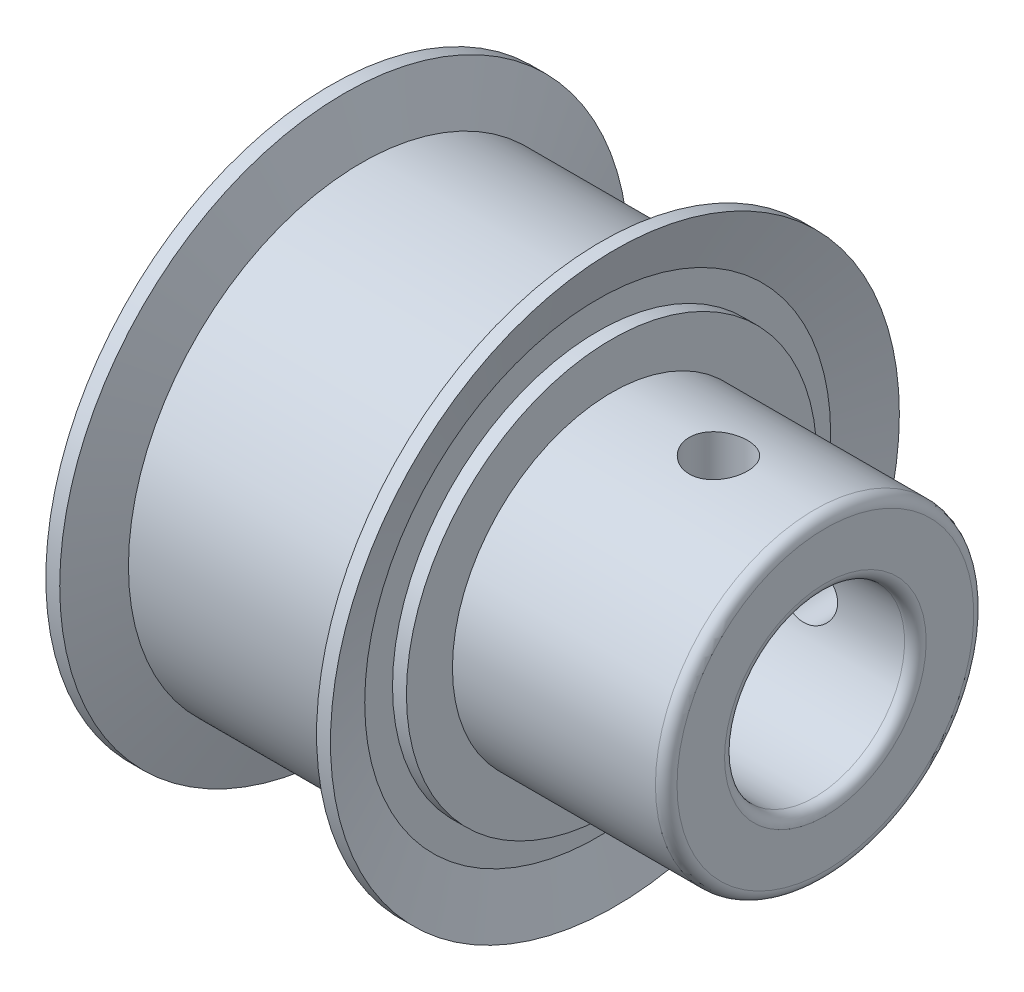
ISO-10303-21;
HEADER;
FILE_DESCRIPTION(('STEP AP214'),'2;1');
FILE_NAME('part.step','',(''),(''),'','','');
FILE_SCHEMA(('AUTOMOTIVE_DESIGN { 1 0 10303 214 1 1 1 1 }'));
ENDSEC;
DATA;
#1=APPLICATION_CONTEXT('core data for automotive mechanical design processes');
#2=APPLICATION_PROTOCOL_DEFINITION('international standard','automotive_design',2000,#1);
#3=PRODUCT_CONTEXT('',#1,'mechanical');
#4=PRODUCT('Part','Part','',(#3));
#5=PRODUCT_RELATED_PRODUCT_CATEGORY('part','',(#4));
#6=PRODUCT_DEFINITION_FORMATION('','',#4);
#7=PRODUCT_DEFINITION_CONTEXT('part definition',#1,'design');
#8=PRODUCT_DEFINITION('design','',#6,#7);
#9=PRODUCT_DEFINITION_SHAPE('','',#8);
#10=(LENGTH_UNIT() NAMED_UNIT(*) SI_UNIT(.MILLI.,.METRE.));
#11=(NAMED_UNIT(*) PLANE_ANGLE_UNIT() SI_UNIT($,.RADIAN.));
#12=(NAMED_UNIT(*) SI_UNIT($,.STERADIAN.) SOLID_ANGLE_UNIT());
#13=UNCERTAINTY_MEASURE_WITH_UNIT(LENGTH_MEASURE(1.E-05),#10,'distance_accuracy_value','');
#14=(GEOMETRIC_REPRESENTATION_CONTEXT(3) GLOBAL_UNCERTAINTY_ASSIGNED_CONTEXT((#13)) GLOBAL_UNIT_ASSIGNED_CONTEXT((#10,
#11,#12)) REPRESENTATION_CONTEXT('',''));
#15=CARTESIAN_POINT('',(0.,0.,0.));
#16=DIRECTION('',(0.,0.,1.));
#17=DIRECTION('',(1.,0.,0.));
#18=AXIS2_PLACEMENT_3D('',#15,#16,#17);
#19=CARTESIAN_POINT('',(-8.6725125,0.,0.));
#20=DIRECTION('',(-1.,0.,0.));
#21=DIRECTION('',(0.,0.,1.));
#22=AXIS2_PLACEMENT_3D('',#19,#20,#21);
#23=CYLINDRICAL_SURFACE('',#22,5.6134);
#24=CARTESIAN_POINT('',(8.2915125,0.,0.));
#25=DIRECTION('',(-1.,0.,0.));
#26=DIRECTION('',(0.,0.,1.));
#27=AXIS2_PLACEMENT_3D('',#24,#25,#26);
#28=CIRCLE('',#27,5.6134);
#29=CARTESIAN_POINT('',(8.2915125,0.,5.6134));
#30=VERTEX_POINT('',#29);
#31=EDGE_CURVE('E10',#30,#30,#28,.T.);
#32=ORIENTED_EDGE('',*,*,#31,.T.);
#33=EDGE_LOOP('',(#32));
#34=FACE_BOUND('',#33,.T.);
#35=CARTESIAN_POINT('',(4.9022,5.51833633172173,-1.0287));
#36=CARTESIAN_POINT('',(4.84494043161623,5.51833742712361,-1.02869777971192));
#37=CARTESIAN_POINT('',(4.78765177515355,5.51923721458514,-1.02390300699142));
#38=CARTESIAN_POINT('',(4.6746881624936,5.52273491839648,-1.00486254906059));
#39=CARTESIAN_POINT('',(4.61901464396117,5.52533430191379,-0.990608698191036));
#40=CARTESIAN_POINT('',(4.51093220953243,5.53192713694505,-0.953101083945397));
#41=CARTESIAN_POINT('',(4.45852036969039,5.53591931803154,-0.929855520183488));
#42=CARTESIAN_POINT('',(4.3583443139881,5.54484642636327,-0.875045795370629));
#43=CARTESIAN_POINT('',(4.31057970205789,5.54978127316139,-0.84348234408129));
#44=CARTESIAN_POINT('',(4.22048186748421,5.56010324210269,-0.77253262052428));
#45=CARTESIAN_POINT('',(4.17821194150111,5.56549462312791,-0.733066576653446));
#46=CARTESIAN_POINT('',(4.10085449324648,5.57608452735736,-0.647604374278682));
#47=CARTESIAN_POINT('',(4.06576743246305,5.58128303815241,-0.601607796519269));
#48=CARTESIAN_POINT('',(4.00353018795788,5.59094698324904,-0.503975606183584));
#49=CARTESIAN_POINT('',(3.97643952413774,5.59540681674078,-0.452301449852942));
#50=CARTESIAN_POINT('',(3.93134735317115,5.60304329112526,-0.345040022131453));
#51=CARTESIAN_POINT('',(3.91334513220725,5.60622003278971,-0.289453058448152));
#52=CARTESIAN_POINT('',(3.88713615143365,5.61090231257746,-0.176599468274449));
#53=CARTESIAN_POINT('',(3.87882275545522,5.6124260308813,-0.119358373562017));
#54=CARTESIAN_POINT('',(3.8718952913783,5.61369320262517,-0.00427493637406973));
#55=CARTESIAN_POINT('',(3.87328043276614,5.61343680116019,0.0535673567149042));
#56=CARTESIAN_POINT('',(3.88562864843766,5.61118686922624,0.167480429115772));
#57=CARTESIAN_POINT('',(3.89647691502881,5.60921416192242,0.223564124196342));
#58=CARTESIAN_POINT('',(3.92726203047362,5.60377659404007,0.333101437181509));
#59=CARTESIAN_POINT('',(3.94719919947425,5.6003116809004,0.386554962367669));
#60=CARTESIAN_POINT('',(3.99570656270977,5.59224407231433,0.489649386065673));
#61=CARTESIAN_POINT('',(4.02432295050508,5.58763531341095,0.539268056002143));
#62=CARTESIAN_POINT('',(4.08934244339367,5.57779020421809,0.633042163974976));
#63=CARTESIAN_POINT('',(4.1257463062019,5.57255379288035,0.677197069731197));
#64=CARTESIAN_POINT('',(4.20594092104614,5.56194332933521,0.759470093264099));
#65=CARTESIAN_POINT('',(4.24983209701438,5.5565683845885,0.797490273314762));
#66=CARTESIAN_POINT('',(4.34342008889079,5.54636017096692,0.865644036479065));
#67=CARTESIAN_POINT('',(4.39311698239748,5.54152690933383,0.895777514162526));
#68=CARTESIAN_POINT('',(4.49703207201332,5.53294816974668,0.947328553110567));
#69=CARTESIAN_POINT('',(4.55125722076122,5.52920440563771,0.968732403150894));
#70=CARTESIAN_POINT('',(4.66261784983907,5.52325519297383,1.00209865707178));
#71=CARTESIAN_POINT('',(4.71975301556101,5.52104957850356,1.01406207927994));
#72=CARTESIAN_POINT('',(4.834430132781,5.51845907217443,1.0280659733714));
#73=CARTESIAN_POINT('',(4.89195436544757,5.51804840765094,1.03024691831815));
#74=CARTESIAN_POINT('',(5.00654520373383,5.51902539922668,1.02500003304941));
#75=CARTESIAN_POINT('',(5.06361183079147,5.52041297058082,1.0175726556433));
#76=CARTESIAN_POINT('',(5.17520906373008,5.52480612395848,0.993440382404391));
#77=CARTESIAN_POINT('',(5.22975604301472,5.52779893685707,0.976808671015054));
#78=CARTESIAN_POINT('',(5.335289009954,5.53505441931817,0.934817302725115));
#79=CARTESIAN_POINT('',(5.38627474514164,5.53931717879835,0.909457027785055));
#80=CARTESIAN_POINT('',(5.4838581259244,5.54869119388387,0.850403364898712));
#81=CARTESIAN_POINT('',(5.53040103836812,5.55381130751408,0.816620965440759));
#82=CARTESIAN_POINT('',(5.6172082098561,5.56429799961617,0.741802492921996));
#83=CARTESIAN_POINT('',(5.65747193017744,5.56966459918422,0.700765798123031));
#84=CARTESIAN_POINT('',(5.7311000568579,5.58012212819403,0.611977282045608));
#85=CARTESIAN_POINT('',(5.76437015602321,5.58520868107143,0.564146660186889));
#86=CARTESIAN_POINT('',(5.82240211596831,5.59446011532827,0.463493278735542));
#87=CARTESIAN_POINT('',(5.8471642938565,5.59862503105703,0.410670705297201));
#88=CARTESIAN_POINT('',(5.88733513308209,5.60554505383219,0.301797576622992));
#89=CARTESIAN_POINT('',(5.90279075051209,5.60830722713205,0.245764815479058));
#90=CARTESIAN_POINT('',(5.92405990585518,5.61214063104353,0.131843583142349));
#91=CARTESIAN_POINT('',(5.92987441093882,5.61321203126846,0.0739552986846543));
#92=CARTESIAN_POINT('',(5.93166385439293,5.61354000610741,-0.0411281212913317));
#93=CARTESIAN_POINT('',(5.92778144831097,5.61282289256322,-0.0983210128114947));
#94=CARTESIAN_POINT('',(5.91059888956355,5.60970888484678,-0.211225017919944));
#95=CARTESIAN_POINT('',(5.89729881862798,5.60731200525215,-0.266936144363169));
#96=CARTESIAN_POINT('',(5.86171747341105,5.60110752299168,-0.375224207798082));
#97=CARTESIAN_POINT('',(5.83945074030924,5.59730220518545,-0.427806061803092));
#98=CARTESIAN_POINT('',(5.78658496317707,5.58869350899216,-0.528508804681552));
#99=CARTESIAN_POINT('',(5.75598539463665,5.58389006778275,-0.576629412486334));
#100=CARTESIAN_POINT('',(5.68682836216999,5.57373257263488,-0.667756270678317));
#101=CARTESIAN_POINT('',(5.64816752434176,5.56837187133017,-0.710683337692931));
#102=CARTESIAN_POINT('',(5.56420050395207,5.55774683424841,-0.789490249394363));
#103=CARTESIAN_POINT('',(5.51889276294629,5.55248252139724,-0.825368436761442));
#104=CARTESIAN_POINT('',(5.42244305357237,5.54259595511088,-0.889353691150498));
#105=CARTESIAN_POINT('',(5.3712533824639,5.53797974053688,-0.917389810417651));
#106=CARTESIAN_POINT('',(5.26482344431583,5.52998438258333,-0.964420069848717));
#107=CARTESIAN_POINT('',(5.20958710720179,5.52660405759356,-0.983422851859365));
#108=CARTESIAN_POINT('',(5.11218006884463,5.52217768875141,-1.00792810786066));
#109=CARTESIAN_POINT('',(5.070584081854,5.52074561637343,-1.01570440255959));
#110=CARTESIAN_POINT('',(4.98673067029886,5.51882454533888,-1.02609110339799));
#111=CARTESIAN_POINT('',(4.94447326236072,5.51833552301478,-1.02870163918142));
#112=CARTESIAN_POINT('',(4.9022,5.51833633172173,-1.0287));
#113=B_SPLINE_CURVE_WITH_KNOTS('',3,(#35,#36,#37,#38,#39,#40,#41,#42,#43,#44,#45,#46,#47,#48,
#49,#50,#51,#52,#53,#54,#55,#56,#57,#58,#59,#60,#61,#62,#63,#64,#65,#66,#67,#68,#69,#70,#71,#72,
#73,#74,#75,#76,#77,#78,#79,#80,#81,#82,#83,#84,#85,#86,#87,#88,#89,#90,#91,#92,#93,#94,#95,#96,
#97,#98,#99,#100,#101,#102,#103,#104,#105,#106,#107,#108,#109,#110,#111,#112),.UNSPECIFIED.,.T.,
.F.,(4,2,2,2,2,2,2,2,2,2,2,2,2,2,2,2,2,2,2,2,2,2,2,2,2,2,2,2,2,2,2,2,2,2,2,2,2,2,4),(0.,
0.171624030673012,0.343396410850821,0.515012518314961,0.686613986592628,0.860043936037365,
1.03348502459638,1.20818629791385,1.38287384784383,1.55562004927316,1.72835217057502,
1.89901738262351,2.06968860663789,2.24128463034694,2.41289735780889,2.58702473016865,
2.76115443016061,2.93555658406465,3.10993992284523,3.28181098885013,3.4536739554187,
3.62418965956506,3.79471743982459,3.96713014806851,4.13955764032268,4.31417913523038,
4.48879412091576,4.66252054205236,4.83622953436547,5.00739811256333,5.17856520531672,
5.3494558281902,5.52035721025584,5.69360219707228,5.86688786831555,6.04169398788424,
6.2163325389223,6.34304131385062,6.46974690875521),.UNSPECIFIED.);
#114=CARTESIAN_POINT('',(4.9022,5.51833633172173,-1.0287));
#115=VERTEX_POINT('',#114);
#116=EDGE_CURVE('E66',#115,#115,#113,.T.);
#117=ORIENTED_EDGE('',*,*,#116,.F.);
#118=EDGE_LOOP('',(#117));
#119=FACE_BOUND('',#118,.T.);
#120=CARTESIAN_POINT('',(1.1318875,0.,0.));
#121=DIRECTION('',(-1.,0.,0.));
#122=DIRECTION('',(0.,0.,1.));
#123=AXIS2_PLACEMENT_3D('',#120,#121,#122);
#124=CIRCLE('',#123,5.6134);
#125=CARTESIAN_POINT('',(1.1318875,0.,5.6134));
#126=VERTEX_POINT('',#125);
#127=EDGE_CURVE('E320',#126,#126,#124,.T.);
#128=ORIENTED_EDGE('',*,*,#127,.F.);
#129=EDGE_LOOP('',(#128));
#130=FACE_BOUND('',#129,.T.);
#131=CARTESIAN_POINT('',(4.9022,-1.02870000000002,-5.51833633172173));
#132=CARTESIAN_POINT('',(4.84494043161623,-1.02869777971194,-5.5183374271236));
#133=CARTESIAN_POINT('',(4.78765177515355,-1.02390300699144,-5.51923721458513));
#134=CARTESIAN_POINT('',(4.6746881624936,-1.00486254906061,-5.52273491839648));
#135=CARTESIAN_POINT('',(4.61901464396117,-0.990608698191055,-5.52533430191379));
#136=CARTESIAN_POINT('',(4.51093220953243,-0.953101083945416,-5.53192713694504));
#137=CARTESIAN_POINT('',(4.45852036969039,-0.929855520183507,-5.53591931803154));
#138=CARTESIAN_POINT('',(4.3583443139881,-0.875045795370649,-5.54484642636327));
#139=CARTESIAN_POINT('',(4.31057970205789,-0.843482344081309,-5.54978127316139));
#140=CARTESIAN_POINT('',(4.22048186748421,-0.7725326205243,-5.56010324210269));
#141=CARTESIAN_POINT('',(4.17821194150111,-0.733066576653465,-5.56549462312791));
#142=CARTESIAN_POINT('',(4.10085449324648,-0.647604374278701,-5.57608452735736));
#143=CARTESIAN_POINT('',(4.06576743246305,-0.601607796519289,-5.58128303815241));
#144=CARTESIAN_POINT('',(4.00353018795788,-0.503975606183603,-5.59094698324904));
#145=CARTESIAN_POINT('',(3.97643952413774,-0.452301449852962,-5.59540681674078));
#146=CARTESIAN_POINT('',(3.93134735317115,-0.345040022131473,-5.60304329112526));
#147=CARTESIAN_POINT('',(3.91334513220725,-0.289453058448171,-5.6062200327897));
#148=CARTESIAN_POINT('',(3.88713615143365,-0.176599468274469,-5.61090231257746));
#149=CARTESIAN_POINT('',(3.87882275545522,-0.119358373562036,-5.6124260308813));
#150=CARTESIAN_POINT('',(3.8718952913783,-0.00427493637408932,-5.61369320262517));
#151=CARTESIAN_POINT('',(3.87328043276614,0.0535673567148846,-5.61343680116019));
#152=CARTESIAN_POINT('',(3.88562864843766,0.167480429115752,-5.61118686922624));
#153=CARTESIAN_POINT('',(3.89647691502881,0.223564124196322,-5.60921416192242));
#154=CARTESIAN_POINT('',(3.92726203047362,0.333101437181489,-5.60377659404007));
#155=CARTESIAN_POINT('',(3.94719919947425,0.386554962367649,-5.6003116809004));
#156=CARTESIAN_POINT('',(3.99570656270977,0.489649386065654,-5.59224407231433));
#157=CARTESIAN_POINT('',(4.02432295050508,0.539268056002124,-5.58763531341095));
#158=CARTESIAN_POINT('',(4.08934244339367,0.633042163974957,-5.57779020421809));
#159=CARTESIAN_POINT('',(4.1257463062019,0.677197069731178,-5.57255379288036));
#160=CARTESIAN_POINT('',(4.20594092104614,0.75947009326408,-5.56194332933522));
#161=CARTESIAN_POINT('',(4.24983209701438,0.797490273314742,-5.5565683845885));
#162=CARTESIAN_POINT('',(4.34342008889079,0.865644036479045,-5.54636017096693));
#163=CARTESIAN_POINT('',(4.39311698239748,0.895777514162507,-5.54152690933383));
#164=CARTESIAN_POINT('',(4.49703207201332,0.947328553110547,-5.53294816974669));
#165=CARTESIAN_POINT('',(4.55125722076122,0.968732403150875,-5.52920440563771));
#166=CARTESIAN_POINT('',(4.66261784983907,1.00209865707176,-5.52325519297383));
#167=CARTESIAN_POINT('',(4.71975301556101,1.01406207927992,-5.52104957850357));
#168=CARTESIAN_POINT('',(4.834430132781,1.02806597337138,-5.51845907217443));
#169=CARTESIAN_POINT('',(4.89195436544757,1.03024691831813,-5.51804840765095));
#170=CARTESIAN_POINT('',(5.00654520373383,1.02500003304939,-5.51902539922668));
#171=CARTESIAN_POINT('',(5.06361183079147,1.01757265564328,-5.52041297058083));
#172=CARTESIAN_POINT('',(5.17520906373008,0.993440382404371,-5.52480612395849));
#173=CARTESIAN_POINT('',(5.22975604301472,0.976808671015034,-5.52779893685708));
#174=CARTESIAN_POINT('',(5.335289009954,0.934817302725096,-5.53505441931818));
#175=CARTESIAN_POINT('',(5.38627474514164,0.909457027785035,-5.53931717879835));
#176=CARTESIAN_POINT('',(5.4838581259244,0.850403364898692,-5.54869119388388));
#177=CARTESIAN_POINT('',(5.53040103836812,0.816620965440739,-5.55381130751408));
#178=CARTESIAN_POINT('',(5.6172082098561,0.741802492921977,-5.56429799961617));
#179=CARTESIAN_POINT('',(5.65747193017744,0.700765798123012,-5.56966459918422));
#180=CARTESIAN_POINT('',(5.7311000568579,0.611977282045588,-5.58012212819403));
#181=CARTESIAN_POINT('',(5.76437015602321,0.564146660186869,-5.58520868107144));
#182=CARTESIAN_POINT('',(5.82240211596831,0.463493278735523,-5.59446011532827));
#183=CARTESIAN_POINT('',(5.8471642938565,0.410670705297182,-5.59862503105703));
#184=CARTESIAN_POINT('',(5.88733513308209,0.301797576622972,-5.60554505383219));
#185=CARTESIAN_POINT('',(5.90279075051209,0.245764815479038,-5.60830722713205));
#186=CARTESIAN_POINT('',(5.92405990585518,0.131843583142329,-5.61214063104353));
#187=CARTESIAN_POINT('',(5.92987441093882,0.0739552986846347,-5.61321203126846));
#188=CARTESIAN_POINT('',(5.93166385439293,-0.0411281212913513,-5.61354000610741));
#189=CARTESIAN_POINT('',(5.92778144831097,-0.0983210128115143,-5.61282289256321));
#190=CARTESIAN_POINT('',(5.91059888956355,-0.211225017919963,-5.60970888484677));
#191=CARTESIAN_POINT('',(5.89729881862798,-0.266936144363188,-5.60731200525215));
#192=CARTESIAN_POINT('',(5.86171747341105,-0.375224207798102,-5.60110752299168));
#193=CARTESIAN_POINT('',(5.83945074030924,-0.427806061803112,-5.59730220518545));
#194=CARTESIAN_POINT('',(5.78658496317707,-0.528508804681571,-5.58869350899216));
#195=CARTESIAN_POINT('',(5.75598539463665,-0.576629412486353,-5.58389006778275));
#196=CARTESIAN_POINT('',(5.68682836216999,-0.667756270678336,-5.57373257263488));
#197=CARTESIAN_POINT('',(5.64816752434176,-0.710683337692951,-5.56837187133017));
#198=CARTESIAN_POINT('',(5.56420050395207,-0.789490249394383,-5.55774683424841));
#199=CARTESIAN_POINT('',(5.51889276294629,-0.825368436761461,-5.55248252139723));
#200=CARTESIAN_POINT('',(5.42244305357237,-0.889353691150518,-5.54259595511088));
#201=CARTESIAN_POINT('',(5.3712533824639,-0.917389810417671,-5.53797974053688));
#202=CARTESIAN_POINT('',(5.26482344431583,-0.964420069848736,-5.52998438258333));
#203=CARTESIAN_POINT('',(5.20958710720179,-0.983422851859384,-5.52660405759356));
#204=CARTESIAN_POINT('',(5.11218006884463,-1.00792810786068,-5.5221776887514));
#205=CARTESIAN_POINT('',(5.070584081854,-1.01570440255961,-5.52074561637343));
#206=CARTESIAN_POINT('',(4.98673067029886,-1.02609110339801,-5.51882454533888));
#207=CARTESIAN_POINT('',(4.94447326236072,-1.02870163918144,-5.51833552301478));
#208=CARTESIAN_POINT('',(4.9022,-1.02870000000002,-5.51833633172173));
#209=B_SPLINE_CURVE_WITH_KNOTS('',3,(#131,#132,#133,#134,#135,#136,#137,#138,#139,#140,#141,
#142,#143,#144,#145,#146,#147,#148,#149,#150,#151,#152,#153,#154,#155,#156,#157,#158,#159,#160,
#161,#162,#163,#164,#165,#166,#167,#168,#169,#170,#171,#172,#173,#174,#175,#176,#177,#178,#179,
#180,#181,#182,#183,#184,#185,#186,#187,#188,#189,#190,#191,#192,#193,#194,#195,#196,#197,#198,
#199,#200,#201,#202,#203,#204,#205,#206,#207,#208),.UNSPECIFIED.,.T.,.F.,(4,2,2,2,2,2,2,2,2,2,2,
2,2,2,2,2,2,2,2,2,2,2,2,2,2,2,2,2,2,2,2,2,2,2,2,2,2,2,4),(0.,0.171624030673012,
0.343396410850821,0.515012518314961,0.686613986592628,0.860043936037365,1.03348502459638,
1.20818629791385,1.38287384784383,1.55562004927316,1.72835217057502,1.89901738262351,
2.06968860663789,2.24128463034694,2.41289735780889,2.58702473016865,2.76115443016061,
2.93555658406465,3.10993992284523,3.28181098885013,3.4536739554187,3.62418965956506,
3.79471743982459,3.96713014806851,4.13955764032268,4.31417913523038,4.48879412091576,
4.66252054205236,4.83622953436547,5.00739811256333,5.17856520531672,5.3494558281902,
5.52035721025584,5.69360219707228,5.86688786831555,6.04169398788425,6.2163325389223,
6.34304131385062,6.46974690875521),.UNSPECIFIED.);
#210=CARTESIAN_POINT('',(4.9022,-1.02870000000002,-5.51833633172173));
#211=VERTEX_POINT('',#210);
#212=EDGE_CURVE('E67',#211,#211,#209,.T.);
#213=ORIENTED_EDGE('',*,*,#212,.F.);
#214=EDGE_LOOP('',(#213));
#215=FACE_BOUND('',#214,.T.);
#216=ADVANCED_FACE('F32',(#34,#119,#130,#215),#23,.T.);
#217=CARTESIAN_POINT('',(-8.6725125,0.,0.));
#218=DIRECTION('',(-1.,0.,0.));
#219=DIRECTION('',(0.,0.,1.));
#220=AXIS2_PLACEMENT_3D('',#217,#218,#219);
#221=CYLINDRICAL_SURFACE('',#220,3.175);
#222=CARTESIAN_POINT('',(-8.2915125,0.,0.));
#223=DIRECTION('',(1.,0.,0.));
#224=DIRECTION('',(0.,0.,-1.));
#225=AXIS2_PLACEMENT_3D('',#222,#223,#224);
#226=CIRCLE('',#225,3.175);
#227=CARTESIAN_POINT('',(-8.2915125,0.,-3.175));
#228=VERTEX_POINT('',#227);
#229=EDGE_CURVE('E52',#228,#228,#226,.F.);
#230=ORIENTED_EDGE('',*,*,#229,.T.);
#231=EDGE_LOOP('',(#230));
#232=FACE_BOUND('',#231,.T.);
#233=CARTESIAN_POINT('',(8.2915125,0.,0.));
#234=DIRECTION('',(-1.,0.,0.));
#235=DIRECTION('',(0.,0.,1.));
#236=AXIS2_PLACEMENT_3D('',#233,#234,#235);
#237=CIRCLE('',#236,3.175);
#238=CARTESIAN_POINT('',(8.2915125,0.,3.175));
#239=VERTEX_POINT('',#238);
#240=EDGE_CURVE('E55',#239,#239,#237,.F.);
#241=ORIENTED_EDGE('',*,*,#240,.T.);
#242=EDGE_LOOP('',(#241));
#243=FACE_BOUND('',#242,.T.);
#244=CARTESIAN_POINT('',(4.9022,3.00373123131881,-1.0287));
#245=CARTESIAN_POINT('',(4.95832978948089,3.00373130819631,-1.02869995774561));
#246=CARTESIAN_POINT('',(5.01446048093578,3.0053217572187,-1.02409045363708));
#247=CARTESIAN_POINT('',(5.1250652383486,3.01148092434195,-1.00583208500836));
#248=CARTESIAN_POINT('',(5.17953895104653,3.01605027293627,-0.992181306864354));
#249=CARTESIAN_POINT('',(5.28521061155036,3.02759653937695,-0.956365131275877));
#250=CARTESIAN_POINT('',(5.33641448497624,3.03456894664408,-0.934215677219287));
#251=CARTESIAN_POINT('',(5.43439504512506,3.05012928898977,-0.882084788236638));
#252=CARTESIAN_POINT('',(5.48117083878581,3.05871754891709,-0.852101777991553));
#253=CARTESIAN_POINT('',(5.57069563193372,3.07689778814418,-0.78396838806786));
#254=CARTESIAN_POINT('',(5.61325707184225,3.08651376390091,-0.745577905637458));
#255=CARTESIAN_POINT('',(5.69146455507164,3.10546251377739,-0.662232371351246));
#256=CARTESIAN_POINT('',(5.72710955556043,3.11479524501202,-0.617276331356055));
#257=CARTESIAN_POINT('',(5.79131268650729,3.13240227144904,-0.520715061317267));
#258=CARTESIAN_POINT('',(5.81967582798639,3.14064503904493,-0.468973928723793));
#259=CARTESIAN_POINT('',(5.86722284513587,3.1548618108118,-0.361142633508739));
#260=CARTESIAN_POINT('',(5.88640904984799,3.16083639055333,-0.305053578562925));
#261=CARTESIAN_POINT('',(5.91442599559339,3.1696736972979,-0.192083915380332));
#262=CARTESIAN_POINT('',(5.92357770750969,3.17263264929515,-0.135290575820387));
#263=CARTESIAN_POINT('',(5.93228481492606,3.17544609325498,-0.0209025095159381));
#264=CARTESIAN_POINT('',(5.93184255057734,3.17530134226916,0.0366920183784407));
#265=CARTESIAN_POINT('',(5.92158129215716,3.17198971505193,0.148781548615439));
#266=CARTESIAN_POINT('',(5.91211061071514,3.16893510321361,0.203312291209548));
#267=CARTESIAN_POINT('',(5.88463531508921,3.16028661264643,0.309963922968445));
#268=CARTESIAN_POINT('',(5.86663013152497,3.15469256449981,0.362084651094158));
#269=CARTESIAN_POINT('',(5.82238435690199,3.14144728315508,0.463217414832771));
#270=CARTESIAN_POINT('',(5.79604167142738,3.13377072532125,0.512181330361635));
#271=CARTESIAN_POINT('',(5.73595175688144,3.1171639483603,0.605099165943572));
#272=CARTESIAN_POINT('',(5.7022025511819,3.10823339480045,0.649051743819862));
#273=CARTESIAN_POINT('',(5.62648719983606,3.08959381547475,0.732773692257345));
#274=CARTESIAN_POINT('',(5.58422155358658,3.0798678347058,0.772268817594068));
#275=CARTESIAN_POINT('',(5.49358018134531,3.06107323482612,0.843696151572826));
#276=CARTESIAN_POINT('',(5.44520362013404,3.05200470584087,0.875627324680548));
#277=CARTESIAN_POINT('',(5.3428877206508,3.0354622232284,0.93137201598979));
#278=CARTESIAN_POINT('',(5.28888505942482,3.02801018514502,0.95507630273516));
#279=CARTESIAN_POINT('',(5.17735357919227,3.01579950993583,0.992964861839772));
#280=CARTESIAN_POINT('',(5.11982615057263,3.01103981826636,1.00715286196233));
#281=CARTESIAN_POINT('',(5.00552159767817,3.00498930655856,1.02506112488732));
#282=CARTESIAN_POINT('',(4.94881810553596,3.00355847110611,1.02920422281201));
#283=CARTESIAN_POINT('',(4.83551962250797,3.00393749095517,1.02809795859974));
#284=CARTESIAN_POINT('',(4.77892461490366,3.00574679857277,1.02285018380941));
#285=CARTESIAN_POINT('',(4.66932566643085,3.01226326202808,1.0034901747044));
#286=CARTESIAN_POINT('',(4.61626476107744,3.0168763463627,0.989665412596827));
#287=CARTESIAN_POINT('',(4.51322418655197,3.02837883196481,0.953885418186881));
#288=CARTESIAN_POINT('',(4.46324504589128,3.03526862239783,0.931928795798957));
#289=CARTESIAN_POINT('',(4.36610607599617,3.05080756029538,0.879749207734983));
#290=CARTESIAN_POINT('',(4.31907792354503,3.05950377480544,0.849295495902666));
#291=CARTESIAN_POINT('',(4.23064599705543,3.07758163296398,0.781251251874369));
#292=CARTESIAN_POINT('',(4.18924379763461,3.0869634673817,0.743658728664317));
#293=CARTESIAN_POINT('',(4.11131308704382,3.10586677210292,0.660391430532027));
#294=CARTESIAN_POINT('',(4.07508813269265,3.1153754949008,0.614428859954324));
#295=CARTESIAN_POINT('',(4.01084911238098,3.13304186316338,0.516844988421185));
#296=CARTESIAN_POINT('',(3.98283471165916,3.14119956370616,0.465223918292459));
#297=CARTESIAN_POINT('',(3.93607541787393,3.15520236870612,0.358076085094469));
#298=CARTESIAN_POINT('',(3.91726662530175,3.16106335711183,0.302579392506388));
#299=CARTESIAN_POINT('',(3.88931976002901,3.16988163406363,0.188984970378092));
#300=CARTESIAN_POINT('',(3.88017840970311,3.1728399067146,0.13088812935314));
#301=CARTESIAN_POINT('',(3.8721079825981,3.17544926197311,0.0165269906246572));
#302=CARTESIAN_POINT('',(3.872741948006,3.17524185520597,-0.039703590726354));
#303=CARTESIAN_POINT('',(3.88313592794776,3.17188727005756,-0.151220130607575));
#304=CARTESIAN_POINT('',(3.89289526982881,3.16874030835777,-0.20650615845717));
#305=CARTESIAN_POINT('',(3.92097811506645,3.1599089434247,-0.313781407008524));
#306=CARTESIAN_POINT('',(3.93917713518882,3.15426147508087,-0.365806470499674));
#307=CARTESIAN_POINT('',(3.98350886415425,3.14101078441556,-0.4660872608465));
#308=CARTESIAN_POINT('',(4.00964297813082,3.13340721574746,-0.51434231821128));
#309=CARTESIAN_POINT('',(4.07017706064463,3.11669521253472,-0.607585714460188));
#310=CARTESIAN_POINT('',(4.10483831455127,3.10754281982326,-0.652396452716262));
#311=CARTESIAN_POINT('',(4.18099094622024,3.08888053008688,-0.735709332476737));
#312=CARTESIAN_POINT('',(4.22248444157435,3.07937052292996,-0.774209510674083));
#313=CARTESIAN_POINT('',(4.31293068309975,3.06065599231411,-0.845227520058139));
#314=CARTESIAN_POINT('',(4.36209987778502,3.05147516839266,-0.877476762671399));
#315=CARTESIAN_POINT('',(4.46544191450498,3.03489133367191,-0.933225533039676));
#316=CARTESIAN_POINT('',(4.51961310724943,3.02748773975106,-0.956727932091853));
#317=CARTESIAN_POINT('',(4.62789941011427,3.01578072438016,-0.992991943416231));
#318=CARTESIAN_POINT('',(4.68179977759509,3.01131033561488,-1.00634068268883));
#319=CARTESIAN_POINT('',(4.79120012284001,3.00528598421396,-1.02419341827129));
#320=CARTESIAN_POINT('',(4.84669962049056,3.00373115530337,-1.02870004178057));
#321=CARTESIAN_POINT('',(4.9022,3.00373123131881,-1.0287));
#322=B_SPLINE_CURVE_WITH_KNOTS('',3,(#244,#245,#246,#247,#248,#249,#250,#251,#252,#253,#254,
#255,#256,#257,#258,#259,#260,#261,#262,#263,#264,#265,#266,#267,#268,#269,#270,#271,#272,#273,
#274,#275,#276,#277,#278,#279,#280,#281,#282,#283,#284,#285,#286,#287,#288,#289,#290,#291,#292,
#293,#294,#295,#296,#297,#298,#299,#300,#301,#302,#303,#304,#305,#306,#307,#308,#309,#310,#311,
#312,#313,#314,#315,#316,#317,#318,#319,#320,#321),.UNSPECIFIED.,.T.,.F.,(4,2,2,2,2,2,2,2,2,2,2,
2,2,2,2,2,2,2,2,2,2,2,2,2,2,2,2,2,2,2,2,2,2,2,2,2,2,2,4),(0.,0.168184075564396,0.33640375937863,
0.504309396460624,0.672248825195171,0.845818160476178,1.01941364552133,1.19726152723874,
1.37506424843858,1.54699685143062,1.71888751729987,1.88440419576601,2.04993191825184,
2.21757054360668,2.38525396234084,2.56042113995048,2.7356122847825,2.91304771671557,
3.09041360217288,3.2601727741571,3.42990325432495,3.59423121915485,3.75858728769463,
3.92793363419934,4.09732728094136,4.27435154634148,4.45136859309065,4.62713882922692,
4.80284945354042,4.9707294792344,5.13859713107507,5.3040638951372,5.46955997688981,
5.64095139567948,5.81239603603664,5.99007774719045,6.16770107980701,6.33404866075044,
6.50034680844694),.UNSPECIFIED.);
#323=CARTESIAN_POINT('',(4.9022,3.00373123131881,-1.0287));
#324=VERTEX_POINT('',#323);
#325=EDGE_CURVE('E59',#324,#324,#322,.T.);
#326=ORIENTED_EDGE('',*,*,#325,.F.);
#327=EDGE_LOOP('',(#326));
#328=FACE_BOUND('',#327,.T.);
#329=CARTESIAN_POINT('',(4.9022,-1.02870000000001,-3.0037312313188));
#330=CARTESIAN_POINT('',(4.95832978948089,-1.02869995774562,-3.0037313081963));
#331=CARTESIAN_POINT('',(5.01446048093578,-1.02409045363709,-3.0053217572187));
#332=CARTESIAN_POINT('',(5.1250652383486,-1.00583208500837,-3.01148092434195));
#333=CARTESIAN_POINT('',(5.17953895104653,-0.992181306864365,-3.01605027293626));
#334=CARTESIAN_POINT('',(5.28521061155035,-0.956365131275888,-3.02759653937695));
#335=CARTESIAN_POINT('',(5.33641448497624,-0.934215677219298,-3.03456894664407));
#336=CARTESIAN_POINT('',(5.43439504512506,-0.882084788236648,-3.05012928898977));
#337=CARTESIAN_POINT('',(5.48117083878581,-0.852101777991564,-3.05871754891709));
#338=CARTESIAN_POINT('',(5.57069563193372,-0.783968388067871,-3.07689778814418));
#339=CARTESIAN_POINT('',(5.61325707184225,-0.745577905637469,-3.08651376390091));
#340=CARTESIAN_POINT('',(5.69146455507164,-0.662232371351257,-3.10546251377739));
#341=CARTESIAN_POINT('',(5.72710955556043,-0.617276331356066,-3.11479524501202));
#342=CARTESIAN_POINT('',(5.79131268650729,-0.520715061317278,-3.13240227144904));
#343=CARTESIAN_POINT('',(5.81967582798639,-0.468973928723804,-3.14064503904493));
#344=CARTESIAN_POINT('',(5.86722284513587,-0.36114263350875,-3.1548618108118));
#345=CARTESIAN_POINT('',(5.88640904984799,-0.305053578562937,-3.16083639055333));
#346=CARTESIAN_POINT('',(5.91442599559339,-0.192083915380343,-3.1696736972979));
#347=CARTESIAN_POINT('',(5.92357770750969,-0.135290575820398,-3.17263264929515));
#348=CARTESIAN_POINT('',(5.93228481492606,-0.0209025095159491,-3.17544609325498));
#349=CARTESIAN_POINT('',(5.93184255057734,0.0366920183784296,-3.17530134226916));
#350=CARTESIAN_POINT('',(5.92158129215716,0.148781548615428,-3.17198971505193));
#351=CARTESIAN_POINT('',(5.91211061071514,0.203312291209537,-3.16893510321361));
#352=CARTESIAN_POINT('',(5.88463531508921,0.309963922968434,-3.16028661264643));
#353=CARTESIAN_POINT('',(5.86663013152497,0.362084651094147,-3.15469256449981));
#354=CARTESIAN_POINT('',(5.82238435690199,0.463217414832761,-3.14144728315508));
#355=CARTESIAN_POINT('',(5.79604167142738,0.512181330361624,-3.13377072532125));
#356=CARTESIAN_POINT('',(5.73595175688144,0.605099165943562,-3.11716394836031));
#357=CARTESIAN_POINT('',(5.7022025511819,0.649051743819851,-3.10823339480045));
#358=CARTESIAN_POINT('',(5.62648719983606,0.732773692257334,-3.08959381547475));
#359=CARTESIAN_POINT('',(5.58422155358658,0.772268817594057,-3.07986783470581));
#360=CARTESIAN_POINT('',(5.49358018134531,0.843696151572816,-3.06107323482612));
#361=CARTESIAN_POINT('',(5.44520362013404,0.875627324680537,-3.05200470584087));
#362=CARTESIAN_POINT('',(5.3428877206508,0.93137201598978,-3.0354622232284));
#363=CARTESIAN_POINT('',(5.28888505942482,0.955076302735149,-3.02801018514502));
#364=CARTESIAN_POINT('',(5.17735357919227,0.992964861839762,-3.01579950993583));
#365=CARTESIAN_POINT('',(5.11982615057263,1.00715286196232,-3.01103981826636));
#366=CARTESIAN_POINT('',(5.00552159767817,1.02506112488731,-3.00498930655856));
#367=CARTESIAN_POINT('',(4.94881810553596,1.029204222812,-3.00355847110612));
#368=CARTESIAN_POINT('',(4.83551962250797,1.02809795859973,-3.00393749095517));
#369=CARTESIAN_POINT('',(4.77892461490366,1.0228501838094,-3.00574679857277));
#370=CARTESIAN_POINT('',(4.66932566643085,1.00349017470439,-3.01226326202808));
#371=CARTESIAN_POINT('',(4.61626476107744,0.989665412596816,-3.0168763463627));
#372=CARTESIAN_POINT('',(4.51322418655197,0.95388541818687,-3.02837883196482));
#373=CARTESIAN_POINT('',(4.46324504589128,0.931928795798946,-3.03526862239783));
#374=CARTESIAN_POINT('',(4.36610607599617,0.879749207734972,-3.05080756029538));
#375=CARTESIAN_POINT('',(4.31907792354503,0.849295495902656,-3.05950377480544));
#376=CARTESIAN_POINT('',(4.23064599705543,0.781251251874358,-3.07758163296398));
#377=CARTESIAN_POINT('',(4.18924379763461,0.743658728664306,-3.0869634673817));
#378=CARTESIAN_POINT('',(4.11131308704382,0.660391430532016,-3.10586677210292));
#379=CARTESIAN_POINT('',(4.07508813269265,0.614428859954314,-3.1153754949008));
#380=CARTESIAN_POINT('',(4.01084911238098,0.516844988421174,-3.13304186316338));
#381=CARTESIAN_POINT('',(3.98283471165916,0.465223918292448,-3.14119956370616));
#382=CARTESIAN_POINT('',(3.93607541787393,0.358076085094458,-3.15520236870612));
#383=CARTESIAN_POINT('',(3.91726662530175,0.302579392506377,-3.16106335711183));
#384=CARTESIAN_POINT('',(3.88931976002901,0.188984970378081,-3.16988163406363));
#385=CARTESIAN_POINT('',(3.88017840970311,0.130888129353129,-3.1728399067146));
#386=CARTESIAN_POINT('',(3.8721079825981,0.0165269906246461,-3.17544926197311));
#387=CARTESIAN_POINT('',(3.872741948006,-0.0397035907263651,-3.17524185520597));
#388=CARTESIAN_POINT('',(3.88313592794776,-0.151220130607586,-3.17188727005756));
#389=CARTESIAN_POINT('',(3.89289526982881,-0.206506158457181,-3.16874030835777));
#390=CARTESIAN_POINT('',(3.92097811506645,-0.313781407008535,-3.1599089434247));
#391=CARTESIAN_POINT('',(3.93917713518882,-0.365806470499685,-3.15426147508087));
#392=CARTESIAN_POINT('',(3.98350886415425,-0.466087260846511,-3.14101078441556));
#393=CARTESIAN_POINT('',(4.00964297813082,-0.514342318211291,-3.13340721574746));
#394=CARTESIAN_POINT('',(4.07017706064463,-0.607585714460199,-3.11669521253472));
#395=CARTESIAN_POINT('',(4.10483831455127,-0.652396452716273,-3.10754281982326));
#396=CARTESIAN_POINT('',(4.18099094622024,-0.735709332476748,-3.08888053008688));
#397=CARTESIAN_POINT('',(4.22248444157435,-0.774209510674094,-3.07937052292995));
#398=CARTESIAN_POINT('',(4.31293068309975,-0.84522752005815,-3.06065599231411));
#399=CARTESIAN_POINT('',(4.36209987778502,-0.87747676267141,-3.05147516839266));
#400=CARTESIAN_POINT('',(4.46544191450498,-0.933225533039686,-3.0348913336719));
#401=CARTESIAN_POINT('',(4.51961310724943,-0.956727932091863,-3.02748773975105));
#402=CARTESIAN_POINT('',(4.62789941011427,-0.992991943416242,-3.01578072438015));
#403=CARTESIAN_POINT('',(4.68179977759509,-1.00634068268884,-3.01131033561487));
#404=CARTESIAN_POINT('',(4.79120012284001,-1.0241934182713,-3.00528598421396));
#405=CARTESIAN_POINT('',(4.84669962049056,-1.02870004178058,-3.00373115530337));
#406=CARTESIAN_POINT('',(4.9022,-1.02870000000001,-3.0037312313188));
#407=B_SPLINE_CURVE_WITH_KNOTS('',3,(#329,#330,#331,#332,#333,#334,#335,#336,#337,#338,#339,
#340,#341,#342,#343,#344,#345,#346,#347,#348,#349,#350,#351,#352,#353,#354,#355,#356,#357,#358,
#359,#360,#361,#362,#363,#364,#365,#366,#367,#368,#369,#370,#371,#372,#373,#374,#375,#376,#377,
#378,#379,#380,#381,#382,#383,#384,#385,#386,#387,#388,#389,#390,#391,#392,#393,#394,#395,#396,
#397,#398,#399,#400,#401,#402,#403,#404,#405,#406),.UNSPECIFIED.,.T.,.F.,(4,2,2,2,2,2,2,2,2,2,2,
2,2,2,2,2,2,2,2,2,2,2,2,2,2,2,2,2,2,2,2,2,2,2,2,2,2,2,4),(0.,0.168184075564396,0.33640375937863,
0.504309396460625,0.672248825195171,0.845818160476177,1.01941364552133,1.19726152723874,
1.37506424843858,1.54699685143062,1.71888751729987,1.88440419576601,2.04993191825184,
2.21757054360668,2.38525396234084,2.56042113995048,2.7356122847825,2.91304771671556,
3.09041360217288,3.2601727741571,3.42990325432495,3.59423121915485,3.75858728769463,
3.92793363419934,4.09732728094136,4.27435154634147,4.45136859309065,4.62713882922692,
4.80284945354042,4.9707294792344,5.13859713107507,5.3040638951372,5.46955997688981,
5.64095139567948,5.81239603603664,5.99007774719045,6.16770107980701,6.33404866075044,
6.50034680844694),.UNSPECIFIED.);
#408=CARTESIAN_POINT('',(4.9022,-1.02870000000001,-3.0037312313188));
#409=VERTEX_POINT('',#408);
#410=EDGE_CURVE('E142',#409,#409,#407,.T.);
#411=ORIENTED_EDGE('',*,*,#410,.F.);
#412=EDGE_LOOP('',(#411));
#413=FACE_BOUND('',#412,.T.);
#414=ADVANCED_FACE('F69',(#232,#243,#328,#413),#221,.F.);
#415=CARTESIAN_POINT('',(-8.6725125,3.175,0.));
#416=DIRECTION('',(1.,0.,0.));
#417=DIRECTION('',(0.,0.,-1.));
#418=AXIS2_PLACEMENT_3D('',#415,#416,#417);
#419=PLANE('',#418);
#420=CARTESIAN_POINT('',(-8.6725125,0.,0.));
#421=DIRECTION('',(1.,0.,0.));
#422=DIRECTION('',(0.,0.,-1.));
#423=AXIS2_PLACEMENT_3D('',#420,#421,#422);
#424=CIRCLE('',#423,3.556);
#425=CARTESIAN_POINT('',(-8.6725125,0.,-3.556));
#426=VERTEX_POINT('',#425);
#427=EDGE_CURVE('E47',#426,#426,#424,.T.);
#428=ORIENTED_EDGE('',*,*,#427,.T.);
#429=EDGE_LOOP('',(#428));
#430=FACE_BOUND('',#429,.T.);
#431=CARTESIAN_POINT('',(-8.6725125,0.,0.));
#432=DIRECTION('',(-1.,0.,0.));
#433=DIRECTION('',(0.,0.,1.));
#434=AXIS2_PLACEMENT_3D('',#431,#432,#433);
#435=CIRCLE('',#434,7.23646);
#436=CARTESIAN_POINT('',(-8.6725125,0.,7.23646));
#437=VERTEX_POINT('',#436);
#438=EDGE_CURVE('E58',#437,#437,#435,.T.);
#439=ORIENTED_EDGE('',*,*,#438,.T.);
#440=EDGE_LOOP('',(#439));
#441=FACE_BOUND('',#440,.T.);
#442=ADVANCED_FACE('F117',(#430,#441),#419,.F.);
#443=CARTESIAN_POINT('',(-8.6725125,0.,0.));
#444=DIRECTION('',(-1.,0.,0.));
#445=DIRECTION('',(0.,0.,1.));
#446=AXIS2_PLACEMENT_3D('',#443,#444,#445);
#447=CYLINDRICAL_SURFACE('',#446,7.23646);
#448=CARTESIAN_POINT('',(-8.1822925,0.,0.));
#449=DIRECTION('',(1.,0.,0.));
#450=DIRECTION('',(0.,0.,-1.));
#451=AXIS2_PLACEMENT_3D('',#448,#449,#450);
#452=CIRCLE('',#451,7.23646);
#453=CARTESIAN_POINT('',(-8.1822925,0.,-7.23646));
#454=VERTEX_POINT('',#453);
#455=EDGE_CURVE('E314',#454,#454,#452,.T.);
#456=ORIENTED_EDGE('',*,*,#455,.F.);
#457=EDGE_LOOP('',(#456));
#458=FACE_BOUND('',#457,.T.);
#459=ORIENTED_EDGE('',*,*,#438,.F.);
#460=EDGE_LOOP('',(#459));
#461=FACE_BOUND('',#460,.T.);
#462=ADVANCED_FACE('F113',(#458,#461),#447,.T.);
#463=CARTESIAN_POINT('',(-8.6725125,0.,0.));
#464=DIRECTION('',(-1.,0.,0.));
#465=DIRECTION('',(0.,0.,1.));
#466=AXIS2_PLACEMENT_3D('',#463,#464,#465);
#467=CYLINDRICAL_SURFACE('',#466,8.2169);
#468=CARTESIAN_POINT('',(-7.6920725,0.,0.));
#469=DIRECTION('',(-1.,0.,0.));
#470=DIRECTION('',(0.,0.,1.));
#471=AXIS2_PLACEMENT_3D('',#468,#469,#470);
#472=CIRCLE('',#471,8.2169);
#473=CARTESIAN_POINT('',(-7.6920725,0.,8.2169));
#474=VERTEX_POINT('',#473);
#475=EDGE_CURVE('E331',#474,#474,#472,.T.);
#476=ORIENTED_EDGE('',*,*,#475,.F.);
#477=EDGE_LOOP('',(#476));
#478=FACE_BOUND('',#477,.T.);
#479=CARTESIAN_POINT('',(0.151447499999998,0.,0.));
#480=DIRECTION('',(1.,0.,0.));
#481=DIRECTION('',(0.,0.,-1.));
#482=AXIS2_PLACEMENT_3D('',#479,#480,#481);
#483=CIRCLE('',#482,8.2169);
#484=CARTESIAN_POINT('',(0.151447499999998,0.,-8.2169));
#485=VERTEX_POINT('',#484);
#486=EDGE_CURVE('E92',#485,#485,#483,.T.);
#487=ORIENTED_EDGE('',*,*,#486,.F.);
#488=EDGE_LOOP('',(#487));
#489=FACE_BOUND('',#488,.T.);
#490=ADVANCED_FACE('F109',(#478,#489),#467,.T.);
#491=CARTESIAN_POINT('',(-8.6725125,0.,0.));
#492=DIRECTION('',(-1.,0.,0.));
#493=DIRECTION('',(0.,0.,1.));
#494=AXIS2_PLACEMENT_3D('',#491,#492,#493);
#495=CYLINDRICAL_SURFACE('',#494,7.23646);
#496=CARTESIAN_POINT('',(0.641667499999998,0.,0.));
#497=DIRECTION('',(1.,0.,0.));
#498=DIRECTION('',(0.,0.,-1.));
#499=AXIS2_PLACEMENT_3D('',#496,#497,#498);
#500=CIRCLE('',#499,7.23646);
#501=CARTESIAN_POINT('',(0.641667499999998,0.,-7.23646));
#502=VERTEX_POINT('',#501);
#503=EDGE_CURVE('E352',#502,#502,#500,.T.);
#504=ORIENTED_EDGE('',*,*,#503,.T.);
#505=EDGE_LOOP('',(#504));
#506=FACE_BOUND('',#505,.T.);
#507=CARTESIAN_POINT('',(1.1318875,0.,0.));
#508=DIRECTION('',(-1.,0.,0.));
#509=DIRECTION('',(0.,0.,1.));
#510=AXIS2_PLACEMENT_3D('',#507,#508,#509);
#511=CIRCLE('',#510,7.23646);
#512=CARTESIAN_POINT('',(1.1318875,0.,7.23646));
#513=VERTEX_POINT('',#512);
#514=EDGE_CURVE('E329',#513,#513,#511,.T.);
#515=ORIENTED_EDGE('',*,*,#514,.T.);
#516=EDGE_LOOP('',(#515));
#517=FACE_BOUND('',#516,.T.);
#518=ADVANCED_FACE('F105',(#506,#517),#495,.T.);
#519=CARTESIAN_POINT('',(1.1318875,7.23646,0.));
#520=DIRECTION('',(-1.,0.,0.));
#521=DIRECTION('',(0.,0.,1.));
#522=AXIS2_PLACEMENT_3D('',#519,#520,#521);
#523=PLANE('',#522);
#524=ORIENTED_EDGE('',*,*,#514,.F.);
#525=EDGE_LOOP('',(#524));
#526=FACE_BOUND('',#525,.T.);
#527=ORIENTED_EDGE('',*,*,#127,.T.);
#528=EDGE_LOOP('',(#527));
#529=FACE_BOUND('',#528,.T.);
#530=ADVANCED_FACE('F102',(#526,#529),#523,.F.);
#531=CARTESIAN_POINT('',(8.6725125,5.6134,0.));
#532=DIRECTION('',(-1.,0.,0.));
#533=DIRECTION('',(0.,0.,1.));
#534=AXIS2_PLACEMENT_3D('',#531,#532,#533);
#535=PLANE('',#534);
#536=CARTESIAN_POINT('',(8.6725125,0.,0.));
#537=DIRECTION('',(-1.,0.,0.));
#538=DIRECTION('',(0.,0.,1.));
#539=AXIS2_PLACEMENT_3D('',#536,#537,#538);
#540=CIRCLE('',#539,3.556);
#541=CARTESIAN_POINT('',(8.6725125,0.,3.556));
#542=VERTEX_POINT('',#541);
#543=EDGE_CURVE('E39',#542,#542,#540,.T.);
#544=ORIENTED_EDGE('',*,*,#543,.T.);
#545=EDGE_LOOP('',(#544));
#546=FACE_BOUND('',#545,.T.);
#547=CARTESIAN_POINT('',(8.6725125,0.,0.));
#548=DIRECTION('',(-1.,0.,0.));
#549=DIRECTION('',(0.,0.,1.));
#550=AXIS2_PLACEMENT_3D('',#547,#548,#549);
#551=CIRCLE('',#550,5.2324);
#552=CARTESIAN_POINT('',(8.6725125,0.,5.2324));
#553=VERTEX_POINT('',#552);
#554=EDGE_CURVE('E43',#553,#553,#551,.F.);
#555=ORIENTED_EDGE('',*,*,#554,.T.);
#556=EDGE_LOOP('',(#555));
#557=FACE_BOUND('',#556,.T.);
#558=ADVANCED_FACE('F101',(#546,#557),#535,.F.);
#559=CARTESIAN_POINT('',(-8.1822925,7.23646,0.));
#560=DIRECTION('',(-1.,0.,0.));
#561=DIRECTION('',(0.,0.,1.));
#562=AXIS2_PLACEMENT_3D('',#559,#560,#561);
#563=PLANE('',#562);
#564=ORIENTED_EDGE('',*,*,#455,.T.);
#565=EDGE_LOOP('',(#564));
#566=FACE_BOUND('',#565,.T.);
#567=CARTESIAN_POINT('',(-8.1822925,0.,0.));
#568=DIRECTION('',(1.,0.,0.));
#569=DIRECTION('',(0.,0.,-1.));
#570=AXIS2_PLACEMENT_3D('',#567,#568,#569);
#571=CIRCLE('',#570,8.2169);
#572=CARTESIAN_POINT('',(-8.1822925,0.,-8.2169));
#573=VERTEX_POINT('',#572);
#574=EDGE_CURVE('E317',#573,#573,#571,.T.);
#575=ORIENTED_EDGE('',*,*,#574,.F.);
#576=EDGE_LOOP('',(#575));
#577=FACE_BOUND('',#576,.T.);
#578=ADVANCED_FACE('F183',(#566,#577),#563,.T.);
#579=CARTESIAN_POINT('',(-8.7899875,0.,0.));
#580=DIRECTION('',(-1.,0.,0.));
#581=DIRECTION('',(0.,0.,1.));
#582=AXIS2_PLACEMENT_3D('',#579,#580,#581);
#583=CONICAL_SURFACE('',#582,10.033,1.24789237037224);
#584=ORIENTED_EDGE('',*,*,#574,.T.);
#585=EDGE_LOOP('',(#584));
#586=FACE_BOUND('',#585,.T.);
#587=CARTESIAN_POINT('',(-8.7899875,0.,0.));
#588=DIRECTION('',(1.,0.,0.));
#589=DIRECTION('',(0.,0.,-1.));
#590=AXIS2_PLACEMENT_3D('',#587,#588,#589);
#591=CIRCLE('',#590,10.033);
#592=CARTESIAN_POINT('',(-8.7899875,0.,-10.033));
#593=VERTEX_POINT('',#592);
#594=EDGE_CURVE('E318',#593,#593,#591,.T.);
#595=ORIENTED_EDGE('',*,*,#594,.F.);
#596=EDGE_LOOP('',(#595));
#597=FACE_BOUND('',#596,.T.);
#598=ADVANCED_FACE('F269',(#586,#597),#583,.F.);
#599=CARTESIAN_POINT('',(0.,0.,0.));
#600=DIRECTION('',(1.,0.,0.));
#601=DIRECTION('',(0.,0.,-1.));
#602=AXIS2_PLACEMENT_3D('',#599,#600,#601);
#603=CYLINDRICAL_SURFACE('',#602,10.033);
#604=ORIENTED_EDGE('',*,*,#594,.T.);
#605=EDGE_LOOP('',(#604));
#606=FACE_BOUND('',#605,.T.);
#607=CARTESIAN_POINT('',(-8.2997675,0.,0.));
#608=DIRECTION('',(1.,0.,0.));
#609=DIRECTION('',(0.,0.,-1.));
#610=AXIS2_PLACEMENT_3D('',#607,#608,#609);
#611=CIRCLE('',#610,10.033);
#612=CARTESIAN_POINT('',(-8.2997675,0.,-10.033));
#613=VERTEX_POINT('',#612);
#614=EDGE_CURVE('E323',#613,#613,#611,.T.);
#615=ORIENTED_EDGE('',*,*,#614,.F.);
#616=EDGE_LOOP('',(#615));
#617=FACE_BOUND('',#616,.T.);
#618=ADVANCED_FACE('F259',(#606,#617),#603,.T.);
#619=CARTESIAN_POINT('',(-7.6920725,0.,0.));
#620=DIRECTION('',(-1.,0.,0.));
#621=DIRECTION('',(0.,0.,1.));
#622=AXIS2_PLACEMENT_3D('',#619,#620,#621);
#623=CONICAL_SURFACE('',#622,8.2169,1.24789237037224);
#624=ORIENTED_EDGE('',*,*,#614,.T.);
#625=EDGE_LOOP('',(#624));
#626=FACE_BOUND('',#625,.T.);
#627=ORIENTED_EDGE('',*,*,#475,.T.);
#628=EDGE_LOOP('',(#627));
#629=FACE_BOUND('',#628,.T.);
#630=ADVANCED_FACE('F249',(#626,#629),#623,.T.);
#631=CARTESIAN_POINT('',(0.641667499999998,7.23646,0.));
#632=DIRECTION('',(1.,0.,0.));
#633=DIRECTION('',(0.,0.,-1.));
#634=AXIS2_PLACEMENT_3D('',#631,#632,#633);
#635=PLANE('',#634);
#636=CARTESIAN_POINT('',(0.641667499999998,0.,0.));
#637=DIRECTION('',(1.,0.,0.));
#638=DIRECTION('',(0.,0.,-1.));
#639=AXIS2_PLACEMENT_3D('',#636,#637,#638);
#640=CIRCLE('',#639,8.2169);
#641=CARTESIAN_POINT('',(0.641667499999998,0.,-8.2169));
#642=VERTEX_POINT('',#641);
#643=EDGE_CURVE('E347',#642,#642,#640,.T.);
#644=ORIENTED_EDGE('',*,*,#643,.T.);
#645=EDGE_LOOP('',(#644));
#646=FACE_BOUND('',#645,.T.);
#647=ORIENTED_EDGE('',*,*,#503,.F.);
#648=EDGE_LOOP('',(#647));
#649=FACE_BOUND('',#648,.T.);
#650=ADVANCED_FACE('F239',(#646,#649),#635,.T.);
#651=CARTESIAN_POINT('',(0.641667499999998,0.,0.));
#652=DIRECTION('',(1.,0.,0.));
#653=DIRECTION('',(0.,0.,-1.));
#654=AXIS2_PLACEMENT_3D('',#651,#652,#653);
#655=CONICAL_SURFACE('',#654,8.2169,1.24789237037224);
#656=CARTESIAN_POINT('',(1.2493625,0.,0.));
#657=DIRECTION('',(1.,0.,0.));
#658=DIRECTION('',(0.,0.,-1.));
#659=AXIS2_PLACEMENT_3D('',#656,#657,#658);
#660=CIRCLE('',#659,10.033);
#661=CARTESIAN_POINT('',(1.2493625,0.,-10.033));
#662=VERTEX_POINT('',#661);
#663=EDGE_CURVE('E344',#662,#662,#660,.T.);
#664=ORIENTED_EDGE('',*,*,#663,.T.);
#665=EDGE_LOOP('',(#664));
#666=FACE_BOUND('',#665,.T.);
#667=ORIENTED_EDGE('',*,*,#643,.F.);
#668=EDGE_LOOP('',(#667));
#669=FACE_BOUND('',#668,.T.);
#670=ADVANCED_FACE('F230',(#666,#669),#655,.F.);
#671=CARTESIAN_POINT('',(0.,0.,0.));
#672=DIRECTION('',(1.,0.,0.));
#673=DIRECTION('',(0.,0.,-1.));
#674=AXIS2_PLACEMENT_3D('',#671,#672,#673);
#675=CYLINDRICAL_SURFACE('',#674,10.033);
#676=CARTESIAN_POINT('',(0.759142499999997,0.,0.));
#677=DIRECTION('',(1.,0.,0.));
#678=DIRECTION('',(0.,0.,-1.));
#679=AXIS2_PLACEMENT_3D('',#676,#677,#678);
#680=CIRCLE('',#679,10.033);
#681=CARTESIAN_POINT('',(0.759142499999997,0.,-10.033));
#682=VERTEX_POINT('',#681);
#683=EDGE_CURVE('E342',#682,#682,#680,.T.);
#684=ORIENTED_EDGE('',*,*,#683,.T.);
#685=EDGE_LOOP('',(#684));
#686=FACE_BOUND('',#685,.T.);
#687=ORIENTED_EDGE('',*,*,#663,.F.);
#688=EDGE_LOOP('',(#687));
#689=FACE_BOUND('',#688,.T.);
#690=ADVANCED_FACE('F221',(#686,#689),#675,.T.);
#691=CARTESIAN_POINT('',(0.759142499999997,0.,0.));
#692=DIRECTION('',(1.,0.,0.));
#693=DIRECTION('',(0.,0.,-1.));
#694=AXIS2_PLACEMENT_3D('',#691,#692,#693);
#695=CONICAL_SURFACE('',#694,10.033,1.24789237037224);
#696=ORIENTED_EDGE('',*,*,#486,.T.);
#697=EDGE_LOOP('',(#696));
#698=FACE_BOUND('',#697,.T.);
#699=ORIENTED_EDGE('',*,*,#683,.F.);
#700=EDGE_LOOP('',(#699));
#701=FACE_BOUND('',#700,.T.);
#702=ADVANCED_FACE('F79',(#698,#701),#695,.T.);
#703=CARTESIAN_POINT('',(4.9022,10.033,0.));
#704=DIRECTION('',(0.,-1.,0.));
#705=DIRECTION('',(0.,0.,-1.));
#706=AXIS2_PLACEMENT_3D('',#703,#704,#705);
#707=CYLINDRICAL_SURFACE('',#706,1.0287);
#708=ORIENTED_EDGE('',*,*,#325,.T.);
#709=EDGE_LOOP('',(#708));
#710=FACE_BOUND('',#709,.T.);
#711=ORIENTED_EDGE('',*,*,#116,.T.);
#712=EDGE_LOOP('',(#711));
#713=FACE_BOUND('',#712,.T.);
#714=ADVANCED_FACE('F73',(#710,#713),#707,.F.);
#715=CARTESIAN_POINT('',(4.9022,0.,-10.033));
#716=DIRECTION('',(0.,0.,1.));
#717=DIRECTION('',(0.,-1.,0.));
#718=AXIS2_PLACEMENT_3D('',#715,#716,#717);
#719=CYLINDRICAL_SURFACE('',#718,1.0287);
#720=ORIENTED_EDGE('',*,*,#410,.T.);
#721=EDGE_LOOP('',(#720));
#722=FACE_BOUND('',#721,.T.);
#723=ORIENTED_EDGE('',*,*,#212,.T.);
#724=EDGE_LOOP('',(#723));
#725=FACE_BOUND('',#724,.T.);
#726=ADVANCED_FACE('F78',(#722,#725),#719,.F.);
#727=CARTESIAN_POINT('',(-8.2915125,0.,0.));
#728=DIRECTION('',(1.,0.,0.));
#729=DIRECTION('',(0.,0.,-1.));
#730=AXIS2_PLACEMENT_3D('',#727,#728,#729);
#731=TOROIDAL_SURFACE('',#730,3.556,0.381);
#732=ORIENTED_EDGE('',*,*,#427,.F.);
#733=EDGE_LOOP('',(#732));
#734=FACE_BOUND('',#733,.T.);
#735=ORIENTED_EDGE('',*,*,#229,.F.);
#736=EDGE_LOOP('',(#735));
#737=FACE_BOUND('',#736,.T.);
#738=ADVANCED_FACE('F122',(#734,#737),#731,.T.);
#739=CARTESIAN_POINT('',(8.2915125,0.,0.));
#740=DIRECTION('',(-1.,0.,0.));
#741=DIRECTION('',(0.,0.,1.));
#742=AXIS2_PLACEMENT_3D('',#739,#740,#741);
#743=TOROIDAL_SURFACE('',#742,3.556,0.381);
#744=ORIENTED_EDGE('',*,*,#240,.F.);
#745=EDGE_LOOP('',(#744));
#746=FACE_BOUND('',#745,.T.);
#747=ORIENTED_EDGE('',*,*,#543,.F.);
#748=EDGE_LOOP('',(#747));
#749=FACE_BOUND('',#748,.T.);
#750=ADVANCED_FACE('F124',(#746,#749),#743,.T.);
#751=CARTESIAN_POINT('',(8.2915125,0.,0.));
#752=DIRECTION('',(-1.,0.,0.));
#753=DIRECTION('',(0.,0.,1.));
#754=AXIS2_PLACEMENT_3D('',#751,#752,#753);
#755=TOROIDAL_SURFACE('',#754,5.2324,0.381);
#756=ORIENTED_EDGE('',*,*,#554,.F.);
#757=EDGE_LOOP('',(#756));
#758=FACE_BOUND('',#757,.T.);
#759=ORIENTED_EDGE('',*,*,#31,.F.);
#760=EDGE_LOOP('',(#759));
#761=FACE_BOUND('',#760,.T.);
#762=ADVANCED_FACE('F34',(#758,#761),#755,.T.);
#763=CLOSED_SHELL('',(#216,#414,#442,#462,#490,#518,#530,#558,#578,#598,#618,#630,#650,#670,
#690,#702,#714,#726,#738,#750,#762));
#764=MANIFOLD_SOLID_BREP('B2',#763);
#765=ADVANCED_BREP_SHAPE_REPRESENTATION('',(#18,#764),#14);
#766=SHAPE_DEFINITION_REPRESENTATION(#9,#765);
ENDSEC;
END-ISO-10303-21;
